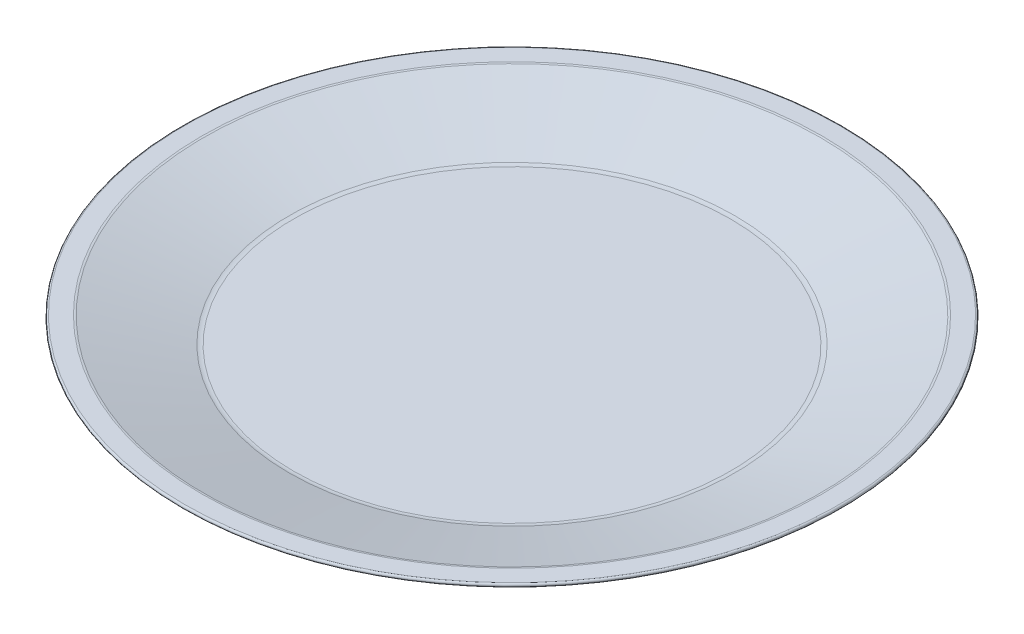
ISO-10303-21;
HEADER;
FILE_DESCRIPTION(('STEP AP214'),'2;1');
FILE_NAME('part.step','',(''),(''),'','','');
FILE_SCHEMA(('AUTOMOTIVE_DESIGN { 1 0 10303 214 1 1 1 1 }'));
ENDSEC;
DATA;
#1=APPLICATION_CONTEXT('core data for automotive mechanical design processes');
#2=APPLICATION_PROTOCOL_DEFINITION('international standard','automotive_design',2000,#1);
#3=PRODUCT_CONTEXT('',#1,'mechanical');
#4=PRODUCT('Part','Part','',(#3));
#5=PRODUCT_RELATED_PRODUCT_CATEGORY('part','',(#4));
#6=PRODUCT_DEFINITION_FORMATION('','',#4);
#7=PRODUCT_DEFINITION_CONTEXT('part definition',#1,'design');
#8=PRODUCT_DEFINITION('design','',#6,#7);
#9=PRODUCT_DEFINITION_SHAPE('','',#8);
#10=(LENGTH_UNIT() NAMED_UNIT(*) SI_UNIT(.MILLI.,.METRE.));
#11=(NAMED_UNIT(*) PLANE_ANGLE_UNIT() SI_UNIT($,.RADIAN.));
#12=(NAMED_UNIT(*) SI_UNIT($,.STERADIAN.) SOLID_ANGLE_UNIT());
#13=UNCERTAINTY_MEASURE_WITH_UNIT(LENGTH_MEASURE(1.E-05),#10,'distance_accuracy_value','');
#14=(GEOMETRIC_REPRESENTATION_CONTEXT(3) GLOBAL_UNCERTAINTY_ASSIGNED_CONTEXT((#13)) GLOBAL_UNIT_ASSIGNED_CONTEXT((#10,
#11,#12)) REPRESENTATION_CONTEXT('',''));
#15=CARTESIAN_POINT('',(0.,0.,0.));
#16=DIRECTION('',(0.,0.,1.));
#17=DIRECTION('',(1.,0.,0.));
#18=AXIS2_PLACEMENT_3D('',#15,#16,#17);
#19=CARTESIAN_POINT('',(0.,2.5,0.));
#20=DIRECTION('',(0.,1.,0.));
#21=DIRECTION('',(0.,0.,1.));
#22=AXIS2_PLACEMENT_3D('',#19,#20,#21);
#23=PLANE('',#22);
#24=CARTESIAN_POINT('',(0.,2.5,0.));
#25=DIRECTION('',(0.,-1.,0.));
#26=DIRECTION('',(0.,0.,-1.));
#27=AXIS2_PLACEMENT_3D('',#24,#25,#26);
#28=CIRCLE('',#27,62.9711914478058);
#29=CARTESIAN_POINT('',(0.,2.5,-62.9711914478058));
#30=VERTEX_POINT('',#29);
#31=EDGE_CURVE('E10',#30,#30,#28,.T.);
#32=ORIENTED_EDGE('',*,*,#31,.F.);
#33=EDGE_LOOP('',(#32));
#34=FACE_BOUND('',#33,.T.);
#35=ADVANCED_FACE('F33',(#34),#23,.T.);
#36=CARTESIAN_POINT('',(0.,7.,0.));
#37=DIRECTION('',(0.,-1.,0.));
#38=DIRECTION('',(0.,0.,-1.));
#39=AXIS2_PLACEMENT_3D('',#36,#37,#38);
#40=TOROIDAL_SURFACE('',#39,62.9711914478058,4.5);
#41=ORIENTED_EDGE('',*,*,#31,.T.);
#42=EDGE_LOOP('',(#41));
#43=FACE_BOUND('',#42,.T.);
#44=CARTESIAN_POINT('',(0.,2.68293917294293,0.));
#45=DIRECTION('',(0.,-1.,0.));
#46=DIRECTION('',(0.,0.,-1.));
#47=AXIS2_PLACEMENT_3D('',#44,#45,#46);
#48=CIRCLE('',#47,64.2412252329822);
#49=CARTESIAN_POINT('',(0.,2.68293917294293,-64.2412252329822));
#50=VERTEX_POINT('',#49);
#51=EDGE_CURVE('E39',#50,#50,#48,.T.);
#52=ORIENTED_EDGE('',*,*,#51,.F.);
#53=EDGE_LOOP('',(#52));
#54=FACE_BOUND('',#53,.T.);
#55=ADVANCED_FACE('F81',(#43,#54),#40,.F.);
#56=CARTESIAN_POINT('',(0.,9.91869370091425,0.));
#57=DIRECTION('',(0.,1.,0.));
#58=DIRECTION('',(0.,0.,1.));
#59=AXIS2_PLACEMENT_3D('',#56,#57,#58);
#60=CONICAL_SURFACE('',#59,88.8367854389409,1.28467879278652);
#61=ORIENTED_EDGE('',*,*,#51,.T.);
#62=EDGE_LOOP('',(#61));
#63=FACE_BOUND('',#62,.T.);
#64=CARTESIAN_POINT('',(0.,9.91869370091425,0.));
#65=DIRECTION('',(0.,-1.,0.));
#66=DIRECTION('',(0.,0.,-1.));
#67=AXIS2_PLACEMENT_3D('',#64,#65,#66);
#68=CIRCLE('',#67,88.8367854389409);
#69=CARTESIAN_POINT('',(0.,9.91869370091425,-88.8367854389409));
#70=VERTEX_POINT('',#69);
#71=EDGE_CURVE('E43',#70,#70,#68,.T.);
#72=ORIENTED_EDGE('',*,*,#71,.F.);
#73=EDGE_LOOP('',(#72));
#74=FACE_BOUND('',#73,.T.);
#75=ADVANCED_FACE('F86',(#63,#74),#60,.F.);
#76=CARTESIAN_POINT('',(0.,8.,0.));
#77=DIRECTION('',(0.,-1.,0.));
#78=DIRECTION('',(0.,0.,-1.));
#79=AXIS2_PLACEMENT_3D('',#76,#77,#78);
#80=TOROIDAL_SURFACE('',#79,89.4012448990193,2.);
#81=ORIENTED_EDGE('',*,*,#71,.T.);
#82=EDGE_LOOP('',(#81));
#83=FACE_BOUND('',#82,.T.);
#84=CARTESIAN_POINT('',(0.,10.,0.));
#85=DIRECTION('',(0.,-1.,0.));
#86=DIRECTION('',(0.,0.,-1.));
#87=AXIS2_PLACEMENT_3D('',#84,#85,#86);
#88=CIRCLE('',#87,89.4012448990193);
#89=CARTESIAN_POINT('',(0.,10.,-89.4012448990193));
#90=VERTEX_POINT('',#89);
#91=EDGE_CURVE('E47',#90,#90,#88,.T.);
#92=ORIENTED_EDGE('',*,*,#91,.F.);
#93=EDGE_LOOP('',(#92));
#94=FACE_BOUND('',#93,.T.);
#95=ADVANCED_FACE('F90',(#83,#94),#80,.T.);
#96=CARTESIAN_POINT('',(94.5,10.,0.));
#97=DIRECTION('',(0.,1.,0.));
#98=DIRECTION('',(0.,0.,1.));
#99=AXIS2_PLACEMENT_3D('',#96,#97,#98);
#100=PLANE('',#99);
#101=ORIENTED_EDGE('',*,*,#91,.T.);
#102=EDGE_LOOP('',(#101));
#103=FACE_BOUND('',#102,.T.);
#104=CARTESIAN_POINT('',(0.,10.,0.));
#105=DIRECTION('',(0.,-1.,0.));
#106=DIRECTION('',(0.,0.,-1.));
#107=AXIS2_PLACEMENT_3D('',#104,#105,#106);
#108=CIRCLE('',#107,94.5);
#109=CARTESIAN_POINT('',(0.,10.,-94.5));
#110=VERTEX_POINT('',#109);
#111=EDGE_CURVE('E52',#110,#110,#108,.T.);
#112=ORIENTED_EDGE('',*,*,#111,.F.);
#113=EDGE_LOOP('',(#112));
#114=FACE_BOUND('',#113,.T.);
#115=ADVANCED_FACE('F96',(#103,#114),#100,.T.);
#116=CARTESIAN_POINT('',(0.,9.5,0.));
#117=DIRECTION('',(0.,-1.,0.));
#118=DIRECTION('',(0.,0.,-1.));
#119=AXIS2_PLACEMENT_3D('',#116,#117,#118);
#120=TOROIDAL_SURFACE('',#119,94.5,0.499999999999998);
#121=ORIENTED_EDGE('',*,*,#111,.T.);
#122=EDGE_LOOP('',(#121));
#123=FACE_BOUND('',#122,.T.);
#124=CARTESIAN_POINT('',(0.,9.02032657477144,0.));
#125=DIRECTION('',(0.,-1.,0.));
#126=DIRECTION('',(0.,0.,-1.));
#127=AXIS2_PLACEMENT_3D('',#124,#125,#126);
#128=CIRCLE('',#127,94.6411148650196);
#129=CARTESIAN_POINT('',(0.,9.02032657477144,-94.6411148650196));
#130=VERTEX_POINT('',#129);
#131=EDGE_CURVE('E55',#130,#130,#128,.T.);
#132=ORIENTED_EDGE('',*,*,#131,.F.);
#133=EDGE_LOOP('',(#132));
#134=FACE_BOUND('',#133,.T.);
#135=ADVANCED_FACE('F77',(#123,#134),#120,.T.);
#136=CARTESIAN_POINT('',(0.,0.284572046800111,0.));
#137=DIRECTION('',(0.,1.,0.));
#138=DIRECTION('',(0.,0.,1.));
#139=AXIS2_PLACEMENT_3D('',#136,#137,#138);
#140=CONICAL_SURFACE('',#139,64.9467995580801,1.28467879278652);
#141=ORIENTED_EDGE('',*,*,#131,.T.);
#142=EDGE_LOOP('',(#141));
#143=FACE_BOUND('',#142,.T.);
#144=CARTESIAN_POINT('',(0.,0.284572046800111,0.));
#145=DIRECTION('',(0.,-1.,0.));
#146=DIRECTION('',(0.,0.,-1.));
#147=AXIS2_PLACEMENT_3D('',#144,#145,#146);
#148=CIRCLE('',#147,64.9467995580801);
#149=CARTESIAN_POINT('',(0.,0.284572046800111,-64.9467995580801));
#150=VERTEX_POINT('',#149);
#151=EDGE_CURVE('E58',#150,#150,#148,.T.);
#152=ORIENTED_EDGE('',*,*,#151,.F.);
#153=EDGE_LOOP('',(#152));
#154=FACE_BOUND('',#153,.T.);
#155=ADVANCED_FACE('F69',(#143,#154),#140,.T.);
#156=CARTESIAN_POINT('',(0.,7.,0.));
#157=DIRECTION('',(0.,-1.,0.));
#158=DIRECTION('',(0.,0.,-1.));
#159=AXIS2_PLACEMENT_3D('',#156,#157,#158);
#160=TOROIDAL_SURFACE('',#159,62.9711914478058,7.);
#161=ORIENTED_EDGE('',*,*,#151,.T.);
#162=EDGE_LOOP('',(#161));
#163=FACE_BOUND('',#162,.T.);
#164=CARTESIAN_POINT('',(0.,0.,0.));
#165=DIRECTION('',(0.,-1.,0.));
#166=DIRECTION('',(0.,0.,-1.));
#167=AXIS2_PLACEMENT_3D('',#164,#165,#166);
#168=CIRCLE('',#167,62.9711914478058);
#169=CARTESIAN_POINT('',(0.,0.,-62.9711914478058));
#170=VERTEX_POINT('',#169);
#171=EDGE_CURVE('E61',#170,#170,#168,.T.);
#172=ORIENTED_EDGE('',*,*,#171,.F.);
#173=EDGE_LOOP('',(#172));
#174=FACE_BOUND('',#173,.T.);
#175=ADVANCED_FACE('F67',(#163,#174),#160,.T.);
#176=CARTESIAN_POINT('',(0.,0.,0.));
#177=DIRECTION('',(0.,-1.,0.));
#178=DIRECTION('',(0.,0.,-1.));
#179=AXIS2_PLACEMENT_3D('',#176,#177,#178);
#180=PLANE('',#179);
#181=ORIENTED_EDGE('',*,*,#171,.T.);
#182=EDGE_LOOP('',(#181));
#183=FACE_BOUND('',#182,.T.);
#184=ADVANCED_FACE('F65',(#183),#180,.T.);
#185=CLOSED_SHELL('',(#35,#55,#75,#95,#115,#135,#155,#175,#184));
#186=MANIFOLD_SOLID_BREP('B2',#185);
#187=ADVANCED_BREP_SHAPE_REPRESENTATION('',(#18,#186),#14);
#188=SHAPE_DEFINITION_REPRESENTATION(#9,#187);
ENDSEC;
END-ISO-10303-21;
